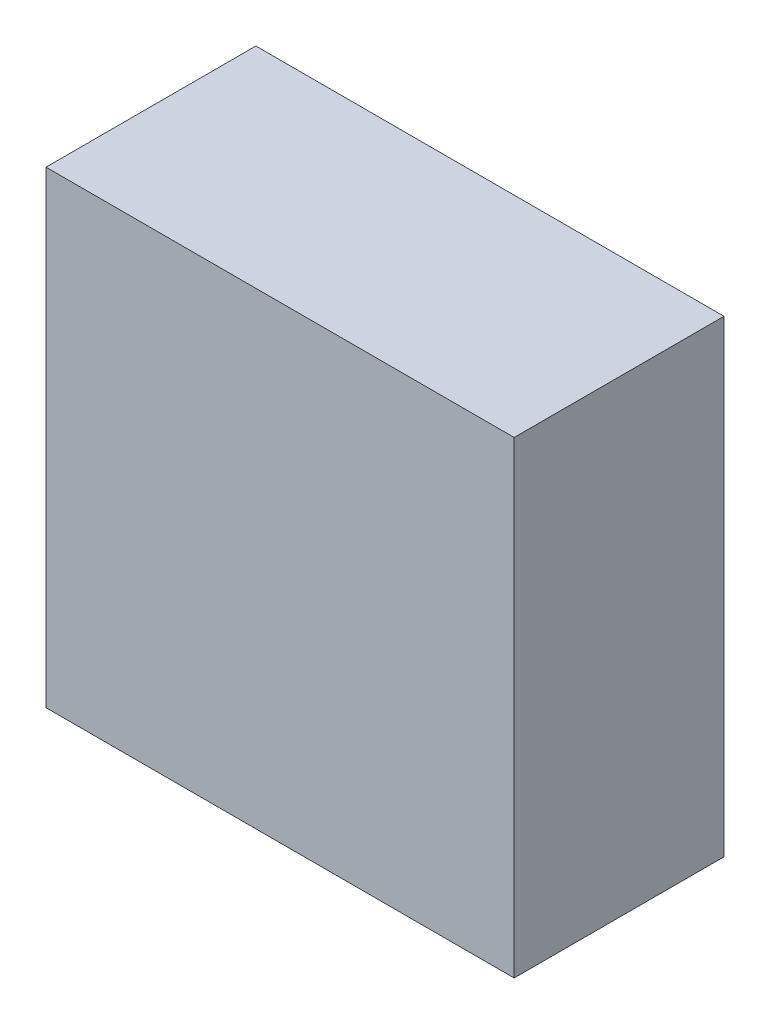
ISO-10303-21;
HEADER;
FILE_DESCRIPTION(('STEP AP214'),'2;1');
FILE_NAME('part.step','',(''),(''),'','','');
FILE_SCHEMA(('AUTOMOTIVE_DESIGN { 1 0 10303 214 1 1 1 1 }'));
ENDSEC;
DATA;
#1=APPLICATION_CONTEXT('core data for automotive mechanical design processes');
#2=APPLICATION_PROTOCOL_DEFINITION('international standard','automotive_design',2000,#1);
#3=PRODUCT_CONTEXT('',#1,'mechanical');
#4=PRODUCT('Part','Part','',(#3));
#5=PRODUCT_RELATED_PRODUCT_CATEGORY('part','',(#4));
#6=PRODUCT_DEFINITION_FORMATION('','',#4);
#7=PRODUCT_DEFINITION_CONTEXT('part definition',#1,'design');
#8=PRODUCT_DEFINITION('design','',#6,#7);
#9=PRODUCT_DEFINITION_SHAPE('','',#8);
#10=(LENGTH_UNIT() NAMED_UNIT(*) SI_UNIT(.MILLI.,.METRE.));
#11=(NAMED_UNIT(*) PLANE_ANGLE_UNIT() SI_UNIT($,.RADIAN.));
#12=(NAMED_UNIT(*) SI_UNIT($,.STERADIAN.) SOLID_ANGLE_UNIT());
#13=UNCERTAINTY_MEASURE_WITH_UNIT(LENGTH_MEASURE(1.E-05),#10,'distance_accuracy_value','');
#14=(GEOMETRIC_REPRESENTATION_CONTEXT(3) GLOBAL_UNCERTAINTY_ASSIGNED_CONTEXT((#13)) GLOBAL_UNIT_ASSIGNED_CONTEXT((#10,
#11,#12)) REPRESENTATION_CONTEXT('',''));
#15=CARTESIAN_POINT('',(0.,0.,0.));
#16=DIRECTION('',(0.,0.,1.));
#17=DIRECTION('',(1.,0.,0.));
#18=AXIS2_PLACEMENT_3D('',#15,#16,#17);
#19=CARTESIAN_POINT('',(72.5,-72.5000000000008,55.));
#20=DIRECTION('',(-1.,0.,0.));
#21=DIRECTION('',(0.,-1.,0.));
#22=AXIS2_PLACEMENT_3D('',#19,#20,#21);
#23=PLANE('',#22);
#24=DIRECTION('',(0.,0.,-1.));
#25=VECTOR('',#24,1.);
#26=CARTESIAN_POINT('',(72.5,-72.5000000000008,55.));
#27=LINE('',#26,#25);
#28=CARTESIAN_POINT('',(72.5,-72.5000000000008,55.));
#29=VERTEX_POINT('',#28);
#30=CARTESIAN_POINT('',(72.5,-72.5000000000008,-10.));
#31=VERTEX_POINT('',#30);
#32=EDGE_CURVE('E110',#29,#31,#27,.T.);
#33=ORIENTED_EDGE('',*,*,#32,.T.);
#34=DIRECTION('',(0.,1.,0.));
#35=VECTOR('',#34,1.);
#36=CARTESIAN_POINT('',(72.5,-72.5000000000008,-10.));
#37=LINE('',#36,#35);
#38=CARTESIAN_POINT('',(72.5,72.5000000000008,-10.));
#39=VERTEX_POINT('',#38);
#40=EDGE_CURVE('E104',#31,#39,#37,.T.);
#41=ORIENTED_EDGE('',*,*,#40,.T.);
#42=DIRECTION('',(0.,0.,-1.));
#43=VECTOR('',#42,1.);
#44=CARTESIAN_POINT('',(72.5,72.5000000000008,55.));
#45=LINE('',#44,#43);
#46=CARTESIAN_POINT('',(72.5,72.5000000000008,55.));
#47=VERTEX_POINT('',#46);
#48=EDGE_CURVE('E11',#47,#39,#45,.T.);
#49=ORIENTED_EDGE('',*,*,#48,.F.);
#50=DIRECTION('',(0.,1.,0.));
#51=VECTOR('',#50,1.);
#52=CARTESIAN_POINT('',(72.5,-72.5000000000008,55.));
#53=LINE('',#52,#51);
#54=EDGE_CURVE('E119',#29,#47,#53,.T.);
#55=ORIENTED_EDGE('',*,*,#54,.F.);
#56=EDGE_LOOP('',(#33,#41,#49,#55));
#57=FACE_BOUND('',#56,.T.);
#58=ADVANCED_FACE('F51',(#57),#23,.F.);
#59=CARTESIAN_POINT('',(-72.5,72.5000000000008,55.));
#60=DIRECTION('',(0.,-1.,0.));
#61=DIRECTION('',(1.,0.,0.));
#62=AXIS2_PLACEMENT_3D('',#59,#60,#61);
#63=PLANE('',#62);
#64=ORIENTED_EDGE('',*,*,#48,.T.);
#65=DIRECTION('',(-1.,0.,0.));
#66=VECTOR('',#65,1.);
#67=CARTESIAN_POINT('',(-72.5,72.5000000000008,-10.));
#68=LINE('',#67,#66);
#69=CARTESIAN_POINT('',(-72.5,72.5000000000008,-10.));
#70=VERTEX_POINT('',#69);
#71=EDGE_CURVE('E94',#39,#70,#68,.T.);
#72=ORIENTED_EDGE('',*,*,#71,.T.);
#73=DIRECTION('',(0.,0.,-1.));
#74=VECTOR('',#73,1.);
#75=CARTESIAN_POINT('',(-72.5,72.5000000000008,55.));
#76=LINE('',#75,#74);
#77=CARTESIAN_POINT('',(-72.5,72.5000000000008,55.));
#78=VERTEX_POINT('',#77);
#79=EDGE_CURVE('E59',#78,#70,#76,.T.);
#80=ORIENTED_EDGE('',*,*,#79,.F.);
#81=DIRECTION('',(-1.,0.,0.));
#82=VECTOR('',#81,1.);
#83=CARTESIAN_POINT('',(-72.5,72.5000000000008,55.));
#84=LINE('',#83,#82);
#85=EDGE_CURVE('E95',#47,#78,#84,.T.);
#86=ORIENTED_EDGE('',*,*,#85,.F.);
#87=EDGE_LOOP('',(#64,#72,#80,#86));
#88=FACE_BOUND('',#87,.T.);
#89=ADVANCED_FACE('F92',(#88),#63,.F.);
#90=CARTESIAN_POINT('',(-72.5,-72.5000000000008,55.));
#91=DIRECTION('',(1.,0.,0.));
#92=DIRECTION('',(0.,1.,0.));
#93=AXIS2_PLACEMENT_3D('',#90,#91,#92);
#94=PLANE('',#93);
#95=ORIENTED_EDGE('',*,*,#79,.T.);
#96=DIRECTION('',(0.,-1.,0.));
#97=VECTOR('',#96,1.);
#98=CARTESIAN_POINT('',(-72.5,-72.5000000000008,-10.));
#99=LINE('',#98,#97);
#100=CARTESIAN_POINT('',(-72.5,-72.5000000000008,-10.));
#101=VERTEX_POINT('',#100);
#102=EDGE_CURVE('E107',#70,#101,#99,.T.);
#103=ORIENTED_EDGE('',*,*,#102,.T.);
#104=DIRECTION('',(0.,0.,-1.));
#105=VECTOR('',#104,1.);
#106=CARTESIAN_POINT('',(-72.5,-72.5000000000008,55.));
#107=LINE('',#106,#105);
#108=CARTESIAN_POINT('',(-72.5,-72.5000000000008,55.));
#109=VERTEX_POINT('',#108);
#110=EDGE_CURVE('E130',#109,#101,#107,.T.);
#111=ORIENTED_EDGE('',*,*,#110,.F.);
#112=DIRECTION('',(0.,-1.,0.));
#113=VECTOR('',#112,1.);
#114=CARTESIAN_POINT('',(-72.5,-72.5000000000008,55.));
#115=LINE('',#114,#113);
#116=EDGE_CURVE('E71',#78,#109,#115,.T.);
#117=ORIENTED_EDGE('',*,*,#116,.F.);
#118=EDGE_LOOP('',(#95,#103,#111,#117));
#119=FACE_BOUND('',#118,.T.);
#120=ADVANCED_FACE('F134',(#119),#94,.F.);
#121=CARTESIAN_POINT('',(-72.5,-72.5000000000008,55.));
#122=DIRECTION('',(0.,1.,0.));
#123=DIRECTION('',(0.,0.,1.));
#124=AXIS2_PLACEMENT_3D('',#121,#122,#123);
#125=PLANE('',#124);
#126=ORIENTED_EDGE('',*,*,#110,.T.);
#127=DIRECTION('',(1.,0.,0.));
#128=VECTOR('',#127,1.);
#129=CARTESIAN_POINT('',(-72.5,-72.5000000000008,-10.));
#130=LINE('',#129,#128);
#131=EDGE_CURVE('E116',#101,#31,#130,.T.);
#132=ORIENTED_EDGE('',*,*,#131,.T.);
#133=ORIENTED_EDGE('',*,*,#32,.F.);
#134=DIRECTION('',(1.,0.,0.));
#135=VECTOR('',#134,1.);
#136=CARTESIAN_POINT('',(-72.5,-72.5000000000008,55.));
#137=LINE('',#136,#135);
#138=EDGE_CURVE('E66',#109,#29,#137,.T.);
#139=ORIENTED_EDGE('',*,*,#138,.F.);
#140=EDGE_LOOP('',(#126,#132,#133,#139));
#141=FACE_BOUND('',#140,.T.);
#142=ADVANCED_FACE('F136',(#141),#125,.F.);
#143=CARTESIAN_POINT('',(0.,0.,55.));
#144=DIRECTION('',(0.,0.,-1.));
#145=DIRECTION('',(-1.,0.,0.));
#146=AXIS2_PLACEMENT_3D('',#143,#144,#145);
#147=PLANE('',#146);
#148=ORIENTED_EDGE('',*,*,#54,.T.);
#149=ORIENTED_EDGE('',*,*,#85,.T.);
#150=ORIENTED_EDGE('',*,*,#116,.T.);
#151=ORIENTED_EDGE('',*,*,#138,.T.);
#152=EDGE_LOOP('',(#148,#149,#150,#151));
#153=FACE_BOUND('',#152,.T.);
#154=ADVANCED_FACE('F137',(#153),#147,.F.);
#155=CARTESIAN_POINT('',(0.,0.,-10.));
#156=DIRECTION('',(0.,0.,-1.));
#157=DIRECTION('',(-1.,0.,0.));
#158=AXIS2_PLACEMENT_3D('',#155,#156,#157);
#159=PLANE('',#158);
#160=ORIENTED_EDGE('',*,*,#40,.F.);
#161=ORIENTED_EDGE('',*,*,#131,.F.);
#162=ORIENTED_EDGE('',*,*,#102,.F.);
#163=ORIENTED_EDGE('',*,*,#71,.F.);
#164=EDGE_LOOP('',(#160,#161,#162,#163));
#165=FACE_BOUND('',#164,.T.);
#166=ADVANCED_FACE('F102',(#165),#159,.T.);
#167=CLOSED_SHELL('',(#58,#89,#120,#142,#154,#166));
#168=MANIFOLD_SOLID_BREP('B2',#167);
#169=ADVANCED_BREP_SHAPE_REPRESENTATION('',(#18,#168),#14);
#170=SHAPE_DEFINITION_REPRESENTATION(#9,#169);
ENDSEC;
END-ISO-10303-21;
